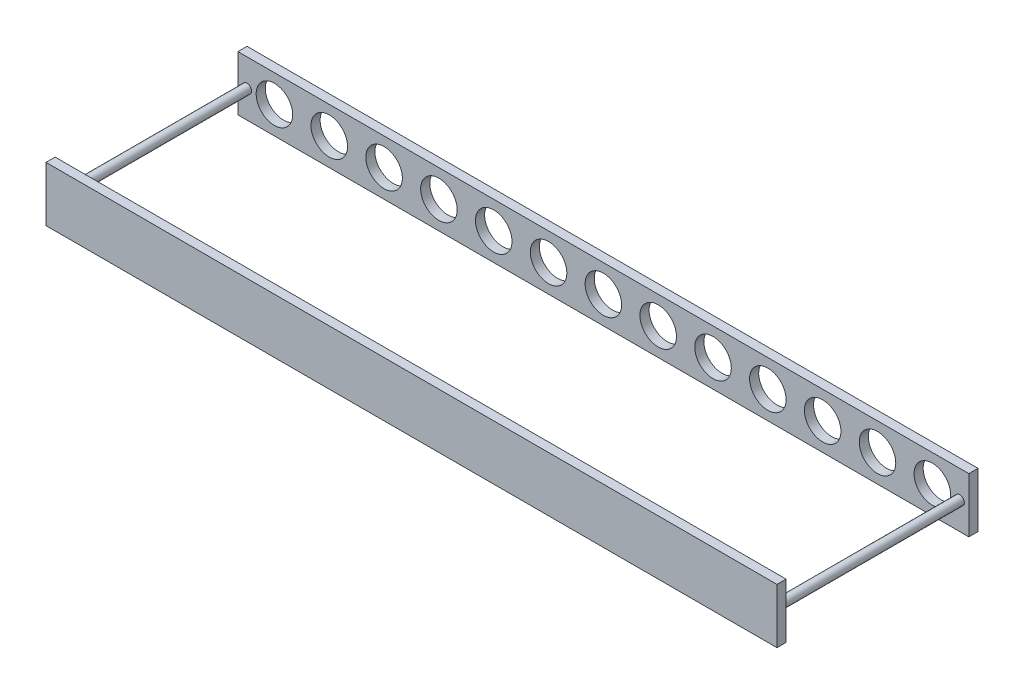
ISO-10303-21;
HEADER;
FILE_DESCRIPTION(('STEP AP214'),'2;1');
FILE_NAME('part.step','',(''),(''),'','','');
FILE_SCHEMA(('AUTOMOTIVE_DESIGN { 1 0 10303 214 1 1 1 1 }'));
ENDSEC;
DATA;
#1=APPLICATION_CONTEXT('core data for automotive mechanical design processes');
#2=APPLICATION_PROTOCOL_DEFINITION('international standard','automotive_design',2000,#1);
#3=PRODUCT_CONTEXT('',#1,'mechanical');
#4=PRODUCT('Part','Part','',(#3));
#5=PRODUCT_RELATED_PRODUCT_CATEGORY('part','',(#4));
#6=PRODUCT_DEFINITION_FORMATION('','',#4);
#7=PRODUCT_DEFINITION_CONTEXT('part definition',#1,'design');
#8=PRODUCT_DEFINITION('design','',#6,#7);
#9=PRODUCT_DEFINITION_SHAPE('','',#8);
#10=(LENGTH_UNIT() NAMED_UNIT(*) SI_UNIT(.MILLI.,.METRE.));
#11=(NAMED_UNIT(*) PLANE_ANGLE_UNIT() SI_UNIT($,.RADIAN.));
#12=(NAMED_UNIT(*) SI_UNIT($,.STERADIAN.) SOLID_ANGLE_UNIT());
#13=UNCERTAINTY_MEASURE_WITH_UNIT(LENGTH_MEASURE(1.E-05),#10,'distance_accuracy_value','');
#14=(GEOMETRIC_REPRESENTATION_CONTEXT(3) GLOBAL_UNCERTAINTY_ASSIGNED_CONTEXT((#13)) GLOBAL_UNIT_ASSIGNED_CONTEXT((#10,
#11,#12)) REPRESENTATION_CONTEXT('',''));
#15=CARTESIAN_POINT('',(0.,0.,0.));
#16=DIRECTION('',(0.,0.,1.));
#17=DIRECTION('',(1.,0.,0.));
#18=AXIS2_PLACEMENT_3D('',#15,#16,#17);
#19=CARTESIAN_POINT('',(0.,0.,10.));
#20=DIRECTION('',(0.,0.,1.));
#21=DIRECTION('',(1.,0.,0.));
#22=AXIS2_PLACEMENT_3D('',#19,#20,#21);
#23=PLANE('',#22);
#24=CARTESIAN_POINT('',(-390.,0.,10.));
#25=DIRECTION('',(0.,0.,1.));
#26=DIRECTION('',(1.,0.,0.));
#27=AXIS2_PLACEMENT_3D('',#24,#25,#26);
#28=CIRCLE('',#27,4.99999999999999);
#29=CARTESIAN_POINT('',(-385.,0.,10.));
#30=VERTEX_POINT('',#29);
#31=EDGE_CURVE('E144',#30,#30,#28,.T.);
#32=ORIENTED_EDGE('',*,*,#31,.F.);
#33=EDGE_LOOP('',(#32));
#34=FACE_BOUND('',#33,.T.);
#35=CARTESIAN_POINT('',(390.,-2.88657986402541E-12,10.));
#36=DIRECTION('',(0.,0.,1.));
#37=DIRECTION('',(-1.,0.,0.));
#38=AXIS2_PLACEMENT_3D('',#35,#36,#37);
#39=CIRCLE('',#38,5.);
#40=CARTESIAN_POINT('',(385.,-2.88657986402541E-12,10.));
#41=VERTEX_POINT('',#40);
#42=EDGE_CURVE('E157',#41,#41,#39,.T.);
#43=ORIENTED_EDGE('',*,*,#42,.F.);
#44=EDGE_LOOP('',(#43));
#45=FACE_BOUND('',#44,.T.);
#46=CARTESIAN_POINT('',(-300.,0.,10.));
#47=DIRECTION('',(0.,0.,1.));
#48=DIRECTION('',(1.,0.,0.));
#49=AXIS2_PLACEMENT_3D('',#46,#47,#48);
#50=CIRCLE('',#49,20.);
#51=CARTESIAN_POINT('',(-280.,0.,10.));
#52=VERTEX_POINT('',#51);
#53=EDGE_CURVE('E175',#52,#52,#50,.T.);
#54=ORIENTED_EDGE('',*,*,#53,.F.);
#55=EDGE_LOOP('',(#54));
#56=FACE_BOUND('',#55,.T.);
#57=CARTESIAN_POINT('',(-180.,0.,10.));
#58=DIRECTION('',(0.,0.,1.));
#59=DIRECTION('',(1.,0.,0.));
#60=AXIS2_PLACEMENT_3D('',#57,#58,#59);
#61=CIRCLE('',#60,20.);
#62=CARTESIAN_POINT('',(-160.,0.,10.));
#63=VERTEX_POINT('',#62);
#64=EDGE_CURVE('E191',#63,#63,#61,.T.);
#65=ORIENTED_EDGE('',*,*,#64,.F.);
#66=EDGE_LOOP('',(#65));
#67=FACE_BOUND('',#66,.T.);
#68=CARTESIAN_POINT('',(-60.,0.,10.));
#69=DIRECTION('',(0.,0.,1.));
#70=DIRECTION('',(1.,0.,0.));
#71=AXIS2_PLACEMENT_3D('',#68,#69,#70);
#72=CIRCLE('',#71,20.);
#73=CARTESIAN_POINT('',(-40.,0.,10.));
#74=VERTEX_POINT('',#73);
#75=EDGE_CURVE('E207',#74,#74,#72,.T.);
#76=ORIENTED_EDGE('',*,*,#75,.F.);
#77=EDGE_LOOP('',(#76));
#78=FACE_BOUND('',#77,.T.);
#79=CARTESIAN_POINT('',(60.,0.,10.));
#80=DIRECTION('',(0.,0.,1.));
#81=DIRECTION('',(1.,0.,0.));
#82=AXIS2_PLACEMENT_3D('',#79,#80,#81);
#83=CIRCLE('',#82,20.);
#84=CARTESIAN_POINT('',(80.,0.,10.));
#85=VERTEX_POINT('',#84);
#86=EDGE_CURVE('E211',#85,#85,#83,.T.);
#87=ORIENTED_EDGE('',*,*,#86,.F.);
#88=EDGE_LOOP('',(#87));
#89=FACE_BOUND('',#88,.T.);
#90=CARTESIAN_POINT('',(0.,0.,10.));
#91=DIRECTION('',(0.,0.,1.));
#92=DIRECTION('',(1.,0.,0.));
#93=AXIS2_PLACEMENT_3D('',#90,#91,#92);
#94=CIRCLE('',#93,20.);
#95=CARTESIAN_POINT('',(20.,0.,10.));
#96=VERTEX_POINT('',#95);
#97=EDGE_CURVE('E223',#96,#96,#94,.T.);
#98=ORIENTED_EDGE('',*,*,#97,.F.);
#99=EDGE_LOOP('',(#98));
#100=FACE_BOUND('',#99,.T.);
#101=DIRECTION('',(0.,1.,0.));
#102=VECTOR('',#101,1.);
#103=CARTESIAN_POINT('',(400.,30.,10.));
#104=LINE('',#103,#102);
#105=CARTESIAN_POINT('',(400.,-30.,10.));
#106=VERTEX_POINT('',#105);
#107=CARTESIAN_POINT('',(400.,30.,10.));
#108=VERTEX_POINT('',#107);
#109=EDGE_CURVE('E231',#106,#108,#104,.T.);
#110=ORIENTED_EDGE('',*,*,#109,.T.);
#111=DIRECTION('',(-1.,0.,0.));
#112=VECTOR('',#111,1.);
#113=CARTESIAN_POINT('',(-400.,30.,10.));
#114=LINE('',#113,#112);
#115=CARTESIAN_POINT('',(-400.,30.,10.));
#116=VERTEX_POINT('',#115);
#117=EDGE_CURVE('E89',#108,#116,#114,.T.);
#118=ORIENTED_EDGE('',*,*,#117,.T.);
#119=DIRECTION('',(0.,-1.,0.));
#120=VECTOR('',#119,1.);
#121=CARTESIAN_POINT('',(-400.,30.,10.));
#122=LINE('',#121,#120);
#123=CARTESIAN_POINT('',(-400.,-30.,10.));
#124=VERTEX_POINT('',#123);
#125=EDGE_CURVE('E236',#116,#124,#122,.T.);
#126=ORIENTED_EDGE('',*,*,#125,.T.);
#127=DIRECTION('',(1.,0.,0.));
#128=VECTOR('',#127,1.);
#129=CARTESIAN_POINT('',(-400.,-30.,10.));
#130=LINE('',#129,#128);
#131=EDGE_CURVE('E57',#124,#106,#130,.T.);
#132=ORIENTED_EDGE('',*,*,#131,.T.);
#133=EDGE_LOOP('',(#110,#118,#126,#132));
#134=FACE_BOUND('',#133,.T.);
#135=CARTESIAN_POINT('',(120.,0.,10.));
#136=DIRECTION('',(0.,0.,1.));
#137=DIRECTION('',(1.,0.,0.));
#138=AXIS2_PLACEMENT_3D('',#135,#136,#137);
#139=CIRCLE('',#138,20.);
#140=CARTESIAN_POINT('',(140.,0.,10.));
#141=VERTEX_POINT('',#140);
#142=EDGE_CURVE('E263',#141,#141,#139,.T.);
#143=ORIENTED_EDGE('',*,*,#142,.F.);
#144=EDGE_LOOP('',(#143));
#145=FACE_BOUND('',#144,.T.);
#146=CARTESIAN_POINT('',(180.,0.,10.));
#147=DIRECTION('',(0.,0.,1.));
#148=DIRECTION('',(1.,0.,0.));
#149=AXIS2_PLACEMENT_3D('',#146,#147,#148);
#150=CIRCLE('',#149,20.);
#151=CARTESIAN_POINT('',(200.,0.,10.));
#152=VERTEX_POINT('',#151);
#153=EDGE_CURVE('E271',#152,#152,#150,.T.);
#154=ORIENTED_EDGE('',*,*,#153,.F.);
#155=EDGE_LOOP('',(#154));
#156=FACE_BOUND('',#155,.T.);
#157=CARTESIAN_POINT('',(240.,0.,10.));
#158=DIRECTION('',(0.,0.,1.));
#159=DIRECTION('',(1.,0.,0.));
#160=AXIS2_PLACEMENT_3D('',#157,#158,#159);
#161=CIRCLE('',#160,20.);
#162=CARTESIAN_POINT('',(260.,0.,10.));
#163=VERTEX_POINT('',#162);
#164=EDGE_CURVE('E279',#163,#163,#161,.T.);
#165=ORIENTED_EDGE('',*,*,#164,.F.);
#166=EDGE_LOOP('',(#165));
#167=FACE_BOUND('',#166,.T.);
#168=CARTESIAN_POINT('',(300.,0.,10.));
#169=DIRECTION('',(0.,0.,1.));
#170=DIRECTION('',(1.,0.,0.));
#171=AXIS2_PLACEMENT_3D('',#168,#169,#170);
#172=CIRCLE('',#171,20.);
#173=CARTESIAN_POINT('',(320.,0.,10.));
#174=VERTEX_POINT('',#173);
#175=EDGE_CURVE('E287',#174,#174,#172,.T.);
#176=ORIENTED_EDGE('',*,*,#175,.F.);
#177=EDGE_LOOP('',(#176));
#178=FACE_BOUND('',#177,.T.);
#179=CARTESIAN_POINT('',(360.,0.,10.));
#180=DIRECTION('',(0.,0.,1.));
#181=DIRECTION('',(1.,0.,0.));
#182=AXIS2_PLACEMENT_3D('',#179,#180,#181);
#183=CIRCLE('',#182,20.);
#184=CARTESIAN_POINT('',(380.,0.,10.));
#185=VERTEX_POINT('',#184);
#186=EDGE_CURVE('E49',#185,#185,#183,.T.);
#187=ORIENTED_EDGE('',*,*,#186,.F.);
#188=EDGE_LOOP('',(#187));
#189=FACE_BOUND('',#188,.T.);
#190=CARTESIAN_POINT('',(-120.,0.,10.));
#191=DIRECTION('',(0.,0.,1.));
#192=DIRECTION('',(1.,0.,0.));
#193=AXIS2_PLACEMENT_3D('',#190,#191,#192);
#194=CIRCLE('',#193,20.);
#195=CARTESIAN_POINT('',(-100.,0.,10.));
#196=VERTEX_POINT('',#195);
#197=EDGE_CURVE('E199',#196,#196,#194,.T.);
#198=ORIENTED_EDGE('',*,*,#197,.F.);
#199=EDGE_LOOP('',(#198));
#200=FACE_BOUND('',#199,.T.);
#201=CARTESIAN_POINT('',(-240.,0.,10.));
#202=DIRECTION('',(0.,0.,1.));
#203=DIRECTION('',(1.,0.,0.));
#204=AXIS2_PLACEMENT_3D('',#201,#202,#203);
#205=CIRCLE('',#204,20.);
#206=CARTESIAN_POINT('',(-220.,0.,10.));
#207=VERTEX_POINT('',#206);
#208=EDGE_CURVE('E183',#207,#207,#205,.T.);
#209=ORIENTED_EDGE('',*,*,#208,.F.);
#210=EDGE_LOOP('',(#209));
#211=FACE_BOUND('',#210,.T.);
#212=CARTESIAN_POINT('',(-360.,0.,10.));
#213=DIRECTION('',(0.,0.,1.));
#214=DIRECTION('',(1.,0.,0.));
#215=AXIS2_PLACEMENT_3D('',#212,#213,#214);
#216=CIRCLE('',#215,20.);
#217=CARTESIAN_POINT('',(-340.,0.,10.));
#218=VERTEX_POINT('',#217);
#219=EDGE_CURVE('E167',#218,#218,#216,.T.);
#220=ORIENTED_EDGE('',*,*,#219,.F.);
#221=EDGE_LOOP('',(#220));
#222=FACE_BOUND('',#221,.T.);
#223=ADVANCED_FACE('F39',(#34,#45,#56,#67,#78,#89,#100,#134,#145,#156,#167,#178,#189,#200,#211,
#222),#23,.T.);
#224=CARTESIAN_POINT('',(0.,0.,0.));
#225=DIRECTION('',(0.,0.,1.));
#226=DIRECTION('',(1.,0.,0.));
#227=AXIS2_PLACEMENT_3D('',#224,#225,#226);
#228=PLANE('',#227);
#229=CARTESIAN_POINT('',(60.,0.,0.));
#230=DIRECTION('',(0.,0.,1.));
#231=DIRECTION('',(1.,0.,0.));
#232=AXIS2_PLACEMENT_3D('',#229,#230,#231);
#233=CIRCLE('',#232,20.);
#234=CARTESIAN_POINT('',(80.,0.,0.));
#235=VERTEX_POINT('',#234);
#236=EDGE_CURVE('E218',#235,#235,#233,.T.);
#237=ORIENTED_EDGE('',*,*,#236,.T.);
#238=EDGE_LOOP('',(#237));
#239=FACE_BOUND('',#238,.T.);
#240=CARTESIAN_POINT('',(0.,0.,0.));
#241=DIRECTION('',(0.,0.,1.));
#242=DIRECTION('',(1.,0.,0.));
#243=AXIS2_PLACEMENT_3D('',#240,#241,#242);
#244=CIRCLE('',#243,20.);
#245=CARTESIAN_POINT('',(20.,0.,0.));
#246=VERTEX_POINT('',#245);
#247=EDGE_CURVE('E222',#246,#246,#244,.T.);
#248=ORIENTED_EDGE('',*,*,#247,.T.);
#249=EDGE_LOOP('',(#248));
#250=FACE_BOUND('',#249,.T.);
#251=DIRECTION('',(0.,1.,0.));
#252=VECTOR('',#251,1.);
#253=CARTESIAN_POINT('',(400.,30.,0.));
#254=LINE('',#253,#252);
#255=CARTESIAN_POINT('',(400.,-30.,0.));
#256=VERTEX_POINT('',#255);
#257=CARTESIAN_POINT('',(400.,30.,0.));
#258=VERTEX_POINT('',#257);
#259=EDGE_CURVE('E227',#256,#258,#254,.T.);
#260=ORIENTED_EDGE('',*,*,#259,.F.);
#261=DIRECTION('',(1.,0.,0.));
#262=VECTOR('',#261,1.);
#263=CARTESIAN_POINT('',(-400.,-30.,0.));
#264=LINE('',#263,#262);
#265=CARTESIAN_POINT('',(-400.,-30.,0.));
#266=VERTEX_POINT('',#265);
#267=EDGE_CURVE('E81',#266,#256,#264,.T.);
#268=ORIENTED_EDGE('',*,*,#267,.F.);
#269=DIRECTION('',(0.,-1.,0.));
#270=VECTOR('',#269,1.);
#271=CARTESIAN_POINT('',(-400.,30.,0.));
#272=LINE('',#271,#270);
#273=CARTESIAN_POINT('',(-400.,30.,0.));
#274=VERTEX_POINT('',#273);
#275=EDGE_CURVE('E75',#274,#266,#272,.T.);
#276=ORIENTED_EDGE('',*,*,#275,.F.);
#277=DIRECTION('',(-1.,0.,0.));
#278=VECTOR('',#277,1.);
#279=CARTESIAN_POINT('',(-400.,30.,0.));
#280=LINE('',#279,#278);
#281=EDGE_CURVE('E245',#258,#274,#280,.T.);
#282=ORIENTED_EDGE('',*,*,#281,.F.);
#283=EDGE_LOOP('',(#260,#268,#276,#282));
#284=FACE_BOUND('',#283,.T.);
#285=CARTESIAN_POINT('',(120.,0.,0.));
#286=DIRECTION('',(0.,0.,1.));
#287=DIRECTION('',(1.,0.,0.));
#288=AXIS2_PLACEMENT_3D('',#285,#286,#287);
#289=CIRCLE('',#288,20.);
#290=CARTESIAN_POINT('',(140.,0.,0.));
#291=VERTEX_POINT('',#290);
#292=EDGE_CURVE('E267',#291,#291,#289,.T.);
#293=ORIENTED_EDGE('',*,*,#292,.T.);
#294=EDGE_LOOP('',(#293));
#295=FACE_BOUND('',#294,.T.);
#296=CARTESIAN_POINT('',(180.,0.,0.));
#297=DIRECTION('',(0.,0.,1.));
#298=DIRECTION('',(1.,0.,0.));
#299=AXIS2_PLACEMENT_3D('',#296,#297,#298);
#300=CIRCLE('',#299,20.);
#301=CARTESIAN_POINT('',(200.,0.,0.));
#302=VERTEX_POINT('',#301);
#303=EDGE_CURVE('E275',#302,#302,#300,.T.);
#304=ORIENTED_EDGE('',*,*,#303,.T.);
#305=EDGE_LOOP('',(#304));
#306=FACE_BOUND('',#305,.T.);
#307=CARTESIAN_POINT('',(240.,0.,0.));
#308=DIRECTION('',(0.,0.,1.));
#309=DIRECTION('',(1.,0.,0.));
#310=AXIS2_PLACEMENT_3D('',#307,#308,#309);
#311=CIRCLE('',#310,20.);
#312=CARTESIAN_POINT('',(260.,0.,0.));
#313=VERTEX_POINT('',#312);
#314=EDGE_CURVE('E283',#313,#313,#311,.T.);
#315=ORIENTED_EDGE('',*,*,#314,.T.);
#316=EDGE_LOOP('',(#315));
#317=FACE_BOUND('',#316,.T.);
#318=CARTESIAN_POINT('',(300.,0.,0.));
#319=DIRECTION('',(0.,0.,1.));
#320=DIRECTION('',(1.,0.,0.));
#321=AXIS2_PLACEMENT_3D('',#318,#319,#320);
#322=CIRCLE('',#321,20.);
#323=CARTESIAN_POINT('',(320.,0.,0.));
#324=VERTEX_POINT('',#323);
#325=EDGE_CURVE('E291',#324,#324,#322,.T.);
#326=ORIENTED_EDGE('',*,*,#325,.T.);
#327=EDGE_LOOP('',(#326));
#328=FACE_BOUND('',#327,.T.);
#329=CARTESIAN_POINT('',(360.,0.,0.));
#330=DIRECTION('',(0.,0.,1.));
#331=DIRECTION('',(1.,0.,0.));
#332=AXIS2_PLACEMENT_3D('',#329,#330,#331);
#333=CIRCLE('',#332,20.);
#334=CARTESIAN_POINT('',(380.,0.,0.));
#335=VERTEX_POINT('',#334);
#336=EDGE_CURVE('E11',#335,#335,#333,.T.);
#337=ORIENTED_EDGE('',*,*,#336,.T.);
#338=EDGE_LOOP('',(#337));
#339=FACE_BOUND('',#338,.T.);
#340=CARTESIAN_POINT('',(-60.,0.,0.));
#341=DIRECTION('',(0.,0.,1.));
#342=DIRECTION('',(1.,0.,0.));
#343=AXIS2_PLACEMENT_3D('',#340,#341,#342);
#344=CIRCLE('',#343,20.);
#345=CARTESIAN_POINT('',(-40.,0.,0.));
#346=VERTEX_POINT('',#345);
#347=EDGE_CURVE('E203',#346,#346,#344,.T.);
#348=ORIENTED_EDGE('',*,*,#347,.T.);
#349=EDGE_LOOP('',(#348));
#350=FACE_BOUND('',#349,.T.);
#351=CARTESIAN_POINT('',(-120.,0.,0.));
#352=DIRECTION('',(0.,0.,1.));
#353=DIRECTION('',(1.,0.,0.));
#354=AXIS2_PLACEMENT_3D('',#351,#352,#353);
#355=CIRCLE('',#354,20.);
#356=CARTESIAN_POINT('',(-100.,0.,0.));
#357=VERTEX_POINT('',#356);
#358=EDGE_CURVE('E195',#357,#357,#355,.T.);
#359=ORIENTED_EDGE('',*,*,#358,.T.);
#360=EDGE_LOOP('',(#359));
#361=FACE_BOUND('',#360,.T.);
#362=CARTESIAN_POINT('',(-180.,0.,0.));
#363=DIRECTION('',(0.,0.,1.));
#364=DIRECTION('',(1.,0.,0.));
#365=AXIS2_PLACEMENT_3D('',#362,#363,#364);
#366=CIRCLE('',#365,20.);
#367=CARTESIAN_POINT('',(-160.,0.,0.));
#368=VERTEX_POINT('',#367);
#369=EDGE_CURVE('E187',#368,#368,#366,.T.);
#370=ORIENTED_EDGE('',*,*,#369,.T.);
#371=EDGE_LOOP('',(#370));
#372=FACE_BOUND('',#371,.T.);
#373=CARTESIAN_POINT('',(-240.,0.,0.));
#374=DIRECTION('',(0.,0.,1.));
#375=DIRECTION('',(1.,0.,0.));
#376=AXIS2_PLACEMENT_3D('',#373,#374,#375);
#377=CIRCLE('',#376,20.);
#378=CARTESIAN_POINT('',(-220.,0.,0.));
#379=VERTEX_POINT('',#378);
#380=EDGE_CURVE('E179',#379,#379,#377,.T.);
#381=ORIENTED_EDGE('',*,*,#380,.T.);
#382=EDGE_LOOP('',(#381));
#383=FACE_BOUND('',#382,.T.);
#384=CARTESIAN_POINT('',(-300.,0.,0.));
#385=DIRECTION('',(0.,0.,1.));
#386=DIRECTION('',(1.,0.,0.));
#387=AXIS2_PLACEMENT_3D('',#384,#385,#386);
#388=CIRCLE('',#387,20.);
#389=CARTESIAN_POINT('',(-280.,0.,0.));
#390=VERTEX_POINT('',#389);
#391=EDGE_CURVE('E171',#390,#390,#388,.T.);
#392=ORIENTED_EDGE('',*,*,#391,.T.);
#393=EDGE_LOOP('',(#392));
#394=FACE_BOUND('',#393,.T.);
#395=CARTESIAN_POINT('',(-360.,0.,0.));
#396=DIRECTION('',(0.,0.,1.));
#397=DIRECTION('',(1.,0.,0.));
#398=AXIS2_PLACEMENT_3D('',#395,#396,#397);
#399=CIRCLE('',#398,20.);
#400=CARTESIAN_POINT('',(-340.,0.,0.));
#401=VERTEX_POINT('',#400);
#402=EDGE_CURVE('E163',#401,#401,#399,.T.);
#403=ORIENTED_EDGE('',*,*,#402,.T.);
#404=EDGE_LOOP('',(#403));
#405=FACE_BOUND('',#404,.T.);
#406=ADVANCED_FACE('F302',(#239,#250,#284,#295,#306,#317,#328,#339,#350,#361,#372,#383,#394,
#405),#228,.F.);
#407=CARTESIAN_POINT('',(360.,0.,10.));
#408=DIRECTION('',(0.,0.,-1.));
#409=DIRECTION('',(-1.,0.,0.));
#410=AXIS2_PLACEMENT_3D('',#407,#408,#409);
#411=CYLINDRICAL_SURFACE('',#410,20.);
#412=ORIENTED_EDGE('',*,*,#186,.T.);
#413=EDGE_LOOP('',(#412));
#414=FACE_BOUND('',#413,.T.);
#415=ORIENTED_EDGE('',*,*,#336,.F.);
#416=EDGE_LOOP('',(#415));
#417=FACE_BOUND('',#416,.T.);
#418=ADVANCED_FACE('F41',(#414,#417),#411,.F.);
#419=CARTESIAN_POINT('',(300.,0.,10.));
#420=DIRECTION('',(0.,0.,-1.));
#421=DIRECTION('',(-1.,0.,0.));
#422=AXIS2_PLACEMENT_3D('',#419,#420,#421);
#423=CYLINDRICAL_SURFACE('',#422,20.);
#424=ORIENTED_EDGE('',*,*,#175,.T.);
#425=EDGE_LOOP('',(#424));
#426=FACE_BOUND('',#425,.T.);
#427=ORIENTED_EDGE('',*,*,#325,.F.);
#428=EDGE_LOOP('',(#427));
#429=FACE_BOUND('',#428,.T.);
#430=ADVANCED_FACE('F325',(#426,#429),#423,.F.);
#431=CARTESIAN_POINT('',(240.,0.,10.));
#432=DIRECTION('',(0.,0.,-1.));
#433=DIRECTION('',(-1.,0.,0.));
#434=AXIS2_PLACEMENT_3D('',#431,#432,#433);
#435=CYLINDRICAL_SURFACE('',#434,20.);
#436=ORIENTED_EDGE('',*,*,#164,.T.);
#437=EDGE_LOOP('',(#436));
#438=FACE_BOUND('',#437,.T.);
#439=ORIENTED_EDGE('',*,*,#314,.F.);
#440=EDGE_LOOP('',(#439));
#441=FACE_BOUND('',#440,.T.);
#442=ADVANCED_FACE('F350',(#438,#441),#435,.F.);
#443=CARTESIAN_POINT('',(180.,0.,10.));
#444=DIRECTION('',(0.,0.,-1.));
#445=DIRECTION('',(-1.,0.,0.));
#446=AXIS2_PLACEMENT_3D('',#443,#444,#445);
#447=CYLINDRICAL_SURFACE('',#446,20.);
#448=ORIENTED_EDGE('',*,*,#153,.T.);
#449=EDGE_LOOP('',(#448));
#450=FACE_BOUND('',#449,.T.);
#451=ORIENTED_EDGE('',*,*,#303,.F.);
#452=EDGE_LOOP('',(#451));
#453=FACE_BOUND('',#452,.T.);
#454=ADVANCED_FACE('F346',(#450,#453),#447,.F.);
#455=CARTESIAN_POINT('',(120.,0.,10.));
#456=DIRECTION('',(0.,0.,-1.));
#457=DIRECTION('',(-1.,0.,0.));
#458=AXIS2_PLACEMENT_3D('',#455,#456,#457);
#459=CYLINDRICAL_SURFACE('',#458,20.);
#460=ORIENTED_EDGE('',*,*,#142,.T.);
#461=EDGE_LOOP('',(#460));
#462=FACE_BOUND('',#461,.T.);
#463=ORIENTED_EDGE('',*,*,#292,.F.);
#464=EDGE_LOOP('',(#463));
#465=FACE_BOUND('',#464,.T.);
#466=ADVANCED_FACE('F342',(#462,#465),#459,.F.);
#467=CARTESIAN_POINT('',(400.,30.,10.));
#468=DIRECTION('',(-1.,0.,0.));
#469=DIRECTION('',(0.,0.,1.));
#470=AXIS2_PLACEMENT_3D('',#467,#468,#469);
#471=PLANE('',#470);
#472=ORIENTED_EDGE('',*,*,#259,.T.);
#473=DIRECTION('',(0.,0.,-1.));
#474=VECTOR('',#473,1.);
#475=CARTESIAN_POINT('',(400.,30.,10.));
#476=LINE('',#475,#474);
#477=EDGE_CURVE('E260',#108,#258,#476,.T.);
#478=ORIENTED_EDGE('',*,*,#477,.F.);
#479=ORIENTED_EDGE('',*,*,#109,.F.);
#480=DIRECTION('',(0.,0.,-1.));
#481=VECTOR('',#480,1.);
#482=CARTESIAN_POINT('',(400.,-30.,10.));
#483=LINE('',#482,#481);
#484=EDGE_CURVE('E241',#106,#256,#483,.T.);
#485=ORIENTED_EDGE('',*,*,#484,.T.);
#486=EDGE_LOOP('',(#472,#478,#479,#485));
#487=FACE_BOUND('',#486,.T.);
#488=ADVANCED_FACE('F339',(#487),#471,.F.);
#489=CARTESIAN_POINT('',(-400.,30.,10.));
#490=DIRECTION('',(0.,-1.,0.));
#491=DIRECTION('',(0.,0.,-1.));
#492=AXIS2_PLACEMENT_3D('',#489,#490,#491);
#493=PLANE('',#492);
#494=ORIENTED_EDGE('',*,*,#281,.T.);
#495=DIRECTION('',(0.,0.,-1.));
#496=VECTOR('',#495,1.);
#497=CARTESIAN_POINT('',(-400.,30.,10.));
#498=LINE('',#497,#496);
#499=EDGE_CURVE('E257',#116,#274,#498,.T.);
#500=ORIENTED_EDGE('',*,*,#499,.F.);
#501=ORIENTED_EDGE('',*,*,#117,.F.);
#502=ORIENTED_EDGE('',*,*,#477,.T.);
#503=EDGE_LOOP('',(#494,#500,#501,#502));
#504=FACE_BOUND('',#503,.T.);
#505=ADVANCED_FACE('F336',(#504),#493,.F.);
#506=CARTESIAN_POINT('',(-400.,30.,10.));
#507=DIRECTION('',(1.,0.,0.));
#508=DIRECTION('',(0.,0.,-1.));
#509=AXIS2_PLACEMENT_3D('',#506,#507,#508);
#510=PLANE('',#509);
#511=ORIENTED_EDGE('',*,*,#275,.T.);
#512=DIRECTION('',(0.,0.,-1.));
#513=VECTOR('',#512,1.);
#514=CARTESIAN_POINT('',(-400.,-30.,10.));
#515=LINE('',#514,#513);
#516=EDGE_CURVE('E254',#124,#266,#515,.T.);
#517=ORIENTED_EDGE('',*,*,#516,.F.);
#518=ORIENTED_EDGE('',*,*,#125,.F.);
#519=ORIENTED_EDGE('',*,*,#499,.T.);
#520=EDGE_LOOP('',(#511,#517,#518,#519));
#521=FACE_BOUND('',#520,.T.);
#522=ADVANCED_FACE('F333',(#521),#510,.F.);
#523=CARTESIAN_POINT('',(-400.,-30.,10.));
#524=DIRECTION('',(0.,1.,0.));
#525=DIRECTION('',(0.,0.,1.));
#526=AXIS2_PLACEMENT_3D('',#523,#524,#525);
#527=PLANE('',#526);
#528=ORIENTED_EDGE('',*,*,#267,.T.);
#529=ORIENTED_EDGE('',*,*,#484,.F.);
#530=ORIENTED_EDGE('',*,*,#131,.F.);
#531=ORIENTED_EDGE('',*,*,#516,.T.);
#532=EDGE_LOOP('',(#528,#529,#530,#531));
#533=FACE_BOUND('',#532,.T.);
#534=ADVANCED_FACE('F329',(#533),#527,.F.);
#535=CARTESIAN_POINT('',(0.,0.,10.));
#536=DIRECTION('',(0.,0.,-1.));
#537=DIRECTION('',(-1.,0.,0.));
#538=AXIS2_PLACEMENT_3D('',#535,#536,#537);
#539=CYLINDRICAL_SURFACE('',#538,20.);
#540=ORIENTED_EDGE('',*,*,#97,.T.);
#541=EDGE_LOOP('',(#540));
#542=FACE_BOUND('',#541,.T.);
#543=ORIENTED_EDGE('',*,*,#247,.F.);
#544=EDGE_LOOP('',(#543));
#545=FACE_BOUND('',#544,.T.);
#546=ADVANCED_FACE('F332',(#542,#545),#539,.F.);
#547=CARTESIAN_POINT('',(60.,0.,10.));
#548=DIRECTION('',(0.,0.,-1.));
#549=DIRECTION('',(-1.,0.,0.));
#550=AXIS2_PLACEMENT_3D('',#547,#548,#549);
#551=CYLINDRICAL_SURFACE('',#550,20.);
#552=ORIENTED_EDGE('',*,*,#86,.T.);
#553=EDGE_LOOP('',(#552));
#554=FACE_BOUND('',#553,.T.);
#555=ORIENTED_EDGE('',*,*,#236,.F.);
#556=EDGE_LOOP('',(#555));
#557=FACE_BOUND('',#556,.T.);
#558=ADVANCED_FACE('F397',(#554,#557),#551,.F.);
#559=CARTESIAN_POINT('',(-60.,0.,10.));
#560=DIRECTION('',(0.,0.,-1.));
#561=DIRECTION('',(-1.,0.,0.));
#562=AXIS2_PLACEMENT_3D('',#559,#560,#561);
#563=CYLINDRICAL_SURFACE('',#562,20.);
#564=ORIENTED_EDGE('',*,*,#75,.T.);
#565=EDGE_LOOP('',(#564));
#566=FACE_BOUND('',#565,.T.);
#567=ORIENTED_EDGE('',*,*,#347,.F.);
#568=EDGE_LOOP('',(#567));
#569=FACE_BOUND('',#568,.T.);
#570=ADVANCED_FACE('F393',(#566,#569),#563,.F.);
#571=CARTESIAN_POINT('',(-120.,0.,10.));
#572=DIRECTION('',(0.,0.,-1.));
#573=DIRECTION('',(-1.,0.,0.));
#574=AXIS2_PLACEMENT_3D('',#571,#572,#573);
#575=CYLINDRICAL_SURFACE('',#574,20.);
#576=ORIENTED_EDGE('',*,*,#197,.T.);
#577=EDGE_LOOP('',(#576));
#578=FACE_BOUND('',#577,.T.);
#579=ORIENTED_EDGE('',*,*,#358,.F.);
#580=EDGE_LOOP('',(#579));
#581=FACE_BOUND('',#580,.T.);
#582=ADVANCED_FACE('F389',(#578,#581),#575,.F.);
#583=CARTESIAN_POINT('',(-180.,0.,10.));
#584=DIRECTION('',(0.,0.,-1.));
#585=DIRECTION('',(-1.,0.,0.));
#586=AXIS2_PLACEMENT_3D('',#583,#584,#585);
#587=CYLINDRICAL_SURFACE('',#586,20.);
#588=ORIENTED_EDGE('',*,*,#64,.T.);
#589=EDGE_LOOP('',(#588));
#590=FACE_BOUND('',#589,.T.);
#591=ORIENTED_EDGE('',*,*,#369,.F.);
#592=EDGE_LOOP('',(#591));
#593=FACE_BOUND('',#592,.T.);
#594=ADVANCED_FACE('F382',(#590,#593),#587,.F.);
#595=CARTESIAN_POINT('',(-240.,0.,10.));
#596=DIRECTION('',(0.,0.,-1.));
#597=DIRECTION('',(-1.,0.,0.));
#598=AXIS2_PLACEMENT_3D('',#595,#596,#597);
#599=CYLINDRICAL_SURFACE('',#598,20.);
#600=ORIENTED_EDGE('',*,*,#208,.T.);
#601=EDGE_LOOP('',(#600));
#602=FACE_BOUND('',#601,.T.);
#603=ORIENTED_EDGE('',*,*,#380,.F.);
#604=EDGE_LOOP('',(#603));
#605=FACE_BOUND('',#604,.T.);
#606=ADVANCED_FACE('F376',(#602,#605),#599,.F.);
#607=CARTESIAN_POINT('',(-300.,0.,10.));
#608=DIRECTION('',(0.,0.,-1.));
#609=DIRECTION('',(-1.,0.,0.));
#610=AXIS2_PLACEMENT_3D('',#607,#608,#609);
#611=CYLINDRICAL_SURFACE('',#610,20.);
#612=ORIENTED_EDGE('',*,*,#53,.T.);
#613=EDGE_LOOP('',(#612));
#614=FACE_BOUND('',#613,.T.);
#615=ORIENTED_EDGE('',*,*,#391,.F.);
#616=EDGE_LOOP('',(#615));
#617=FACE_BOUND('',#616,.T.);
#618=ADVANCED_FACE('F315',(#614,#617),#611,.F.);
#619=CARTESIAN_POINT('',(-360.,0.,10.));
#620=DIRECTION('',(0.,0.,-1.));
#621=DIRECTION('',(-1.,0.,0.));
#622=AXIS2_PLACEMENT_3D('',#619,#620,#621);
#623=CYLINDRICAL_SURFACE('',#622,20.);
#624=ORIENTED_EDGE('',*,*,#219,.T.);
#625=EDGE_LOOP('',(#624));
#626=FACE_BOUND('',#625,.T.);
#627=ORIENTED_EDGE('',*,*,#402,.F.);
#628=EDGE_LOOP('',(#627));
#629=FACE_BOUND('',#628,.T.);
#630=ADVANCED_FACE('F311',(#626,#629),#623,.F.);
#631=CARTESIAN_POINT('',(390.,-2.88657986402541E-12,210.));
#632=DIRECTION('',(0.,0.,-1.));
#633=DIRECTION('',(-1.,0.,0.));
#634=AXIS2_PLACEMENT_3D('',#631,#632,#633);
#635=CYLINDRICAL_SURFACE('',#634,5.);
#636=CARTESIAN_POINT('',(390.,-2.88657986402541E-12,210.));
#637=DIRECTION('',(0.,0.,1.));
#638=DIRECTION('',(-1.,0.,0.));
#639=AXIS2_PLACEMENT_3D('',#636,#637,#638);
#640=CIRCLE('',#639,5.);
#641=CARTESIAN_POINT('',(385.,-2.88657986402541E-12,210.));
#642=VERTEX_POINT('',#641);
#643=EDGE_CURVE('E159',#642,#642,#640,.T.);
#644=ORIENTED_EDGE('',*,*,#643,.F.);
#645=EDGE_LOOP('',(#644));
#646=FACE_BOUND('',#645,.T.);
#647=ORIENTED_EDGE('',*,*,#42,.T.);
#648=EDGE_LOOP('',(#647));
#649=FACE_BOUND('',#648,.T.);
#650=ADVANCED_FACE('F314',(#646,#649),#635,.T.);
#651=CARTESIAN_POINT('',(-390.,0.,210.));
#652=DIRECTION('',(0.,0.,-1.));
#653=DIRECTION('',(-1.,0.,0.));
#654=AXIS2_PLACEMENT_3D('',#651,#652,#653);
#655=CYLINDRICAL_SURFACE('',#654,4.99999999999999);
#656=CARTESIAN_POINT('',(-390.,0.,210.));
#657=DIRECTION('',(0.,0.,1.));
#658=DIRECTION('',(1.,0.,0.));
#659=AXIS2_PLACEMENT_3D('',#656,#657,#658);
#660=CIRCLE('',#659,4.99999999999999);
#661=CARTESIAN_POINT('',(-385.,0.,210.));
#662=VERTEX_POINT('',#661);
#663=EDGE_CURVE('E149',#662,#662,#660,.T.);
#664=ORIENTED_EDGE('',*,*,#663,.F.);
#665=EDGE_LOOP('',(#664));
#666=FACE_BOUND('',#665,.T.);
#667=ORIENTED_EDGE('',*,*,#31,.T.);
#668=EDGE_LOOP('',(#667));
#669=FACE_BOUND('',#668,.T.);
#670=ADVANCED_FACE('F480',(#666,#669),#655,.T.);
#671=CARTESIAN_POINT('',(-400.,30.,220.));
#672=DIRECTION('',(1.,0.,0.));
#673=DIRECTION('',(0.,0.,-1.));
#674=AXIS2_PLACEMENT_3D('',#671,#672,#673);
#675=PLANE('',#674);
#676=DIRECTION('',(0.,-1.,0.));
#677=VECTOR('',#676,1.);
#678=CARTESIAN_POINT('',(-400.,30.,210.));
#679=LINE('',#678,#677);
#680=CARTESIAN_POINT('',(-400.,30.,210.));
#681=VERTEX_POINT('',#680);
#682=CARTESIAN_POINT('',(-400.,-30.,210.));
#683=VERTEX_POINT('',#682);
#684=EDGE_CURVE('E142',#681,#683,#679,.T.);
#685=ORIENTED_EDGE('',*,*,#684,.T.);
#686=DIRECTION('',(0.,0.,-1.));
#687=VECTOR('',#686,1.);
#688=CARTESIAN_POINT('',(-400.,-30.,220.));
#689=LINE('',#688,#687);
#690=CARTESIAN_POINT('',(-400.,-30.,220.));
#691=VERTEX_POINT('',#690);
#692=EDGE_CURVE('E120',#691,#683,#689,.T.);
#693=ORIENTED_EDGE('',*,*,#692,.F.);
#694=DIRECTION('',(0.,-1.,0.));
#695=VECTOR('',#694,1.);
#696=CARTESIAN_POINT('',(-400.,30.,220.));
#697=LINE('',#696,#695);
#698=CARTESIAN_POINT('',(-400.,30.,220.));
#699=VERTEX_POINT('',#698);
#700=EDGE_CURVE('E128',#699,#691,#697,.T.);
#701=ORIENTED_EDGE('',*,*,#700,.F.);
#702=DIRECTION('',(0.,0.,-1.));
#703=VECTOR('',#702,1.);
#704=CARTESIAN_POINT('',(-400.,30.,220.));
#705=LINE('',#704,#703);
#706=EDGE_CURVE('E566',#699,#681,#705,.T.);
#707=ORIENTED_EDGE('',*,*,#706,.T.);
#708=EDGE_LOOP('',(#685,#693,#701,#707));
#709=FACE_BOUND('',#708,.T.);
#710=ADVANCED_FACE('F140',(#709),#675,.F.);
#711=CARTESIAN_POINT('',(400.,-29.9999999999999,220.));
#712=DIRECTION('',(0.,1.,0.));
#713=DIRECTION('',(-1.,0.,0.));
#714=AXIS2_PLACEMENT_3D('',#711,#712,#713);
#715=PLANE('',#714);
#716=DIRECTION('',(1.,0.,0.));
#717=VECTOR('',#716,1.);
#718=CARTESIAN_POINT('',(400.,-29.9999999999999,210.));
#719=LINE('',#718,#717);
#720=CARTESIAN_POINT('',(400.,-29.9999999999999,210.));
#721=VERTEX_POINT('',#720);
#722=EDGE_CURVE('E553',#683,#721,#719,.T.);
#723=ORIENTED_EDGE('',*,*,#722,.T.);
#724=DIRECTION('',(0.,0.,-1.));
#725=VECTOR('',#724,1.);
#726=CARTESIAN_POINT('',(400.,-29.9999999999999,220.));
#727=LINE('',#726,#725);
#728=CARTESIAN_POINT('',(400.,-29.9999999999999,220.));
#729=VERTEX_POINT('',#728);
#730=EDGE_CURVE('E123',#729,#721,#727,.T.);
#731=ORIENTED_EDGE('',*,*,#730,.F.);
#732=DIRECTION('',(1.,0.,0.));
#733=VECTOR('',#732,1.);
#734=CARTESIAN_POINT('',(400.,-29.9999999999999,220.));
#735=LINE('',#734,#733);
#736=EDGE_CURVE('E116',#691,#729,#735,.T.);
#737=ORIENTED_EDGE('',*,*,#736,.F.);
#738=ORIENTED_EDGE('',*,*,#692,.T.);
#739=EDGE_LOOP('',(#723,#731,#737,#738));
#740=FACE_BOUND('',#739,.T.);
#741=ADVANCED_FACE('F118',(#740),#715,.F.);
#742=CARTESIAN_POINT('',(400.,30.,220.));
#743=DIRECTION('',(-1.,0.,0.));
#744=DIRECTION('',(0.,0.,1.));
#745=AXIS2_PLACEMENT_3D('',#742,#743,#744);
#746=PLANE('',#745);
#747=DIRECTION('',(0.,1.,0.));
#748=VECTOR('',#747,1.);
#749=CARTESIAN_POINT('',(400.,30.,210.));
#750=LINE('',#749,#748);
#751=CARTESIAN_POINT('',(400.,30.,210.));
#752=VERTEX_POINT('',#751);
#753=EDGE_CURVE('E557',#721,#752,#750,.T.);
#754=ORIENTED_EDGE('',*,*,#753,.T.);
#755=DIRECTION('',(0.,0.,-1.));
#756=VECTOR('',#755,1.);
#757=CARTESIAN_POINT('',(400.,30.,220.));
#758=LINE('',#757,#756);
#759=CARTESIAN_POINT('',(400.,30.,220.));
#760=VERTEX_POINT('',#759);
#761=EDGE_CURVE('E151',#760,#752,#758,.T.);
#762=ORIENTED_EDGE('',*,*,#761,.F.);
#763=DIRECTION('',(0.,1.,0.));
#764=VECTOR('',#763,1.);
#765=CARTESIAN_POINT('',(400.,30.,220.));
#766=LINE('',#765,#764);
#767=EDGE_CURVE('E127',#729,#760,#766,.T.);
#768=ORIENTED_EDGE('',*,*,#767,.F.);
#769=ORIENTED_EDGE('',*,*,#730,.T.);
#770=EDGE_LOOP('',(#754,#762,#768,#769));
#771=FACE_BOUND('',#770,.T.);
#772=ADVANCED_FACE('F506',(#771),#746,.F.);
#773=CARTESIAN_POINT('',(400.,30.,220.));
#774=DIRECTION('',(0.,-1.,0.));
#775=DIRECTION('',(1.,0.,0.));
#776=AXIS2_PLACEMENT_3D('',#773,#774,#775);
#777=PLANE('',#776);
#778=DIRECTION('',(-1.,0.,0.));
#779=VECTOR('',#778,1.);
#780=CARTESIAN_POINT('',(400.,30.,210.));
#781=LINE('',#780,#779);
#782=EDGE_CURVE('E138',#752,#681,#781,.T.);
#783=ORIENTED_EDGE('',*,*,#782,.T.);
#784=ORIENTED_EDGE('',*,*,#706,.F.);
#785=DIRECTION('',(-1.,0.,0.));
#786=VECTOR('',#785,1.);
#787=CARTESIAN_POINT('',(400.,30.,220.));
#788=LINE('',#787,#786);
#789=EDGE_CURVE('E133',#760,#699,#788,.T.);
#790=ORIENTED_EDGE('',*,*,#789,.F.);
#791=ORIENTED_EDGE('',*,*,#761,.T.);
#792=EDGE_LOOP('',(#783,#784,#790,#791));
#793=FACE_BOUND('',#792,.T.);
#794=ADVANCED_FACE('F515',(#793),#777,.F.);
#795=CARTESIAN_POINT('',(0.,0.,220.));
#796=DIRECTION('',(0.,0.,-1.));
#797=DIRECTION('',(-1.,0.,0.));
#798=AXIS2_PLACEMENT_3D('',#795,#796,#797);
#799=PLANE('',#798);
#800=ORIENTED_EDGE('',*,*,#700,.T.);
#801=ORIENTED_EDGE('',*,*,#736,.T.);
#802=ORIENTED_EDGE('',*,*,#767,.T.);
#803=ORIENTED_EDGE('',*,*,#789,.T.);
#804=EDGE_LOOP('',(#800,#801,#802,#803));
#805=FACE_BOUND('',#804,.T.);
#806=ADVANCED_FACE('F131',(#805),#799,.F.);
#807=CARTESIAN_POINT('',(0.,0.,210.));
#808=DIRECTION('',(0.,0.,-1.));
#809=DIRECTION('',(-1.,0.,0.));
#810=AXIS2_PLACEMENT_3D('',#807,#808,#809);
#811=PLANE('',#810);
#812=ORIENTED_EDGE('',*,*,#643,.T.);
#813=EDGE_LOOP('',(#812));
#814=FACE_BOUND('',#813,.T.);
#815=ORIENTED_EDGE('',*,*,#663,.T.);
#816=EDGE_LOOP('',(#815));
#817=FACE_BOUND('',#816,.T.);
#818=ORIENTED_EDGE('',*,*,#684,.F.);
#819=ORIENTED_EDGE('',*,*,#782,.F.);
#820=ORIENTED_EDGE('',*,*,#753,.F.);
#821=ORIENTED_EDGE('',*,*,#722,.F.);
#822=EDGE_LOOP('',(#818,#819,#820,#821));
#823=FACE_BOUND('',#822,.T.);
#824=ADVANCED_FACE('F534',(#814,#817,#823),#811,.T.);
#825=CLOSED_SHELL('',(#223,#406,#418,#430,#442,#454,#466,#488,#505,#522,#534,#546,#558,#570,
#582,#594,#606,#618,#630,#650,#670,#710,#741,#772,#794,#806,#824));
#826=MANIFOLD_SOLID_BREP('B2',#825);
#827=ADVANCED_BREP_SHAPE_REPRESENTATION('',(#18,#826),#14);
#828=SHAPE_DEFINITION_REPRESENTATION(#9,#827);
ENDSEC;
END-ISO-10303-21;
